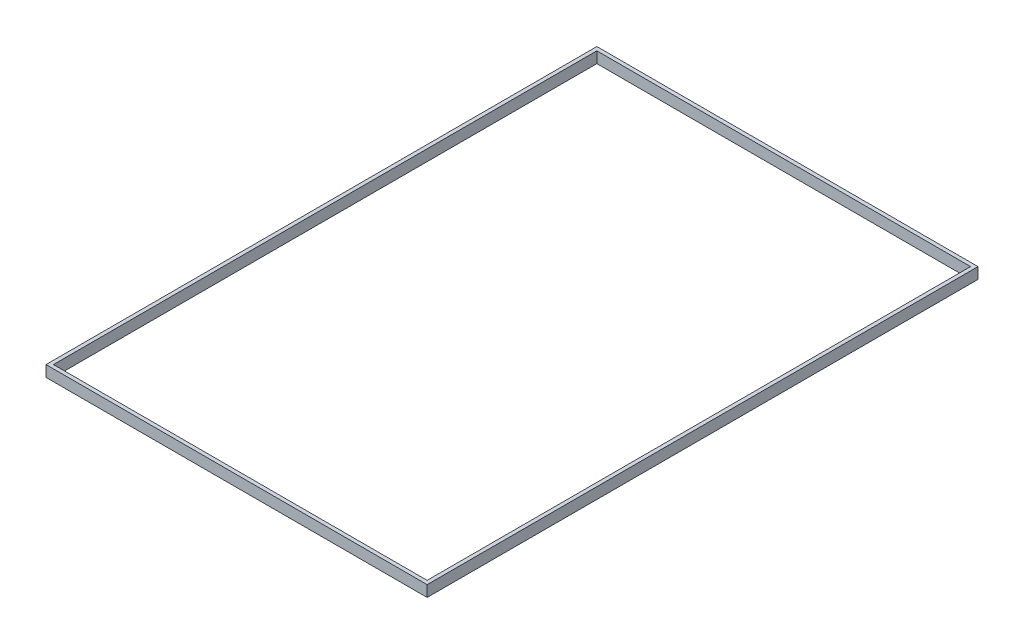
ISO-10303-21;
HEADER;
FILE_DESCRIPTION(('STEP AP214'),'2;1');
FILE_NAME('part.step','',(''),(''),'','','');
FILE_SCHEMA(('AUTOMOTIVE_DESIGN { 1 0 10303 214 1 1 1 1 }'));
ENDSEC;
DATA;
#1=APPLICATION_CONTEXT('core data for automotive mechanical design processes');
#2=APPLICATION_PROTOCOL_DEFINITION('international standard','automotive_design',2000,#1);
#3=PRODUCT_CONTEXT('',#1,'mechanical');
#4=PRODUCT('Part','Part','',(#3));
#5=PRODUCT_RELATED_PRODUCT_CATEGORY('part','',(#4));
#6=PRODUCT_DEFINITION_FORMATION('','',#4);
#7=PRODUCT_DEFINITION_CONTEXT('part definition',#1,'design');
#8=PRODUCT_DEFINITION('design','',#6,#7);
#9=PRODUCT_DEFINITION_SHAPE('','',#8);
#10=(LENGTH_UNIT() NAMED_UNIT(*) SI_UNIT(.MILLI.,.METRE.));
#11=(NAMED_UNIT(*) PLANE_ANGLE_UNIT() SI_UNIT($,.RADIAN.));
#12=(NAMED_UNIT(*) SI_UNIT($,.STERADIAN.) SOLID_ANGLE_UNIT());
#13=UNCERTAINTY_MEASURE_WITH_UNIT(LENGTH_MEASURE(1.E-05),#10,'distance_accuracy_value','');
#14=(GEOMETRIC_REPRESENTATION_CONTEXT(3) GLOBAL_UNCERTAINTY_ASSIGNED_CONTEXT((#13)) GLOBAL_UNIT_ASSIGNED_CONTEXT((#10,
#11,#12)) REPRESENTATION_CONTEXT('',''));
#15=CARTESIAN_POINT('',(0.,0.,0.));
#16=DIRECTION('',(0.,0.,1.));
#17=DIRECTION('',(1.,0.,0.));
#18=AXIS2_PLACEMENT_3D('',#15,#16,#17);
#19=CARTESIAN_POINT('',(0.,3.,0.));
#20=DIRECTION('',(0.,-1.,0.));
#21=DIRECTION('',(0.,0.,-1.));
#22=AXIS2_PLACEMENT_3D('',#19,#20,#21);
#23=PLANE('',#22);
#24=DIRECTION('',(0.,0.,1.));
#25=VECTOR('',#24,1.);
#26=CARTESIAN_POINT('',(0.,3.,0.));
#27=LINE('',#26,#25);
#28=CARTESIAN_POINT('',(0.,3.,-148.5));
#29=VERTEX_POINT('',#28);
#30=CARTESIAN_POINT('',(0.,3.,0.));
#31=VERTEX_POINT('',#30);
#32=EDGE_CURVE('E159',#29,#31,#27,.T.);
#33=ORIENTED_EDGE('',*,*,#32,.T.);
#34=DIRECTION('',(1.,0.,0.));
#35=VECTOR('',#34,1.);
#36=CARTESIAN_POINT('',(0.,3.,0.));
#37=LINE('',#36,#35);
#38=CARTESIAN_POINT('',(102.75,3.,0.));
#39=VERTEX_POINT('',#38);
#40=EDGE_CURVE('E163',#31,#39,#37,.T.);
#41=ORIENTED_EDGE('',*,*,#40,.T.);
#42=DIRECTION('',(0.,0.,-1.));
#43=VECTOR('',#42,1.);
#44=CARTESIAN_POINT('',(102.75,3.,0.));
#45=LINE('',#44,#43);
#46=CARTESIAN_POINT('',(102.75,3.,-148.5));
#47=VERTEX_POINT('',#46);
#48=EDGE_CURVE('E167',#39,#47,#45,.T.);
#49=ORIENTED_EDGE('',*,*,#48,.T.);
#50=DIRECTION('',(-1.,0.,0.));
#51=VECTOR('',#50,1.);
#52=CARTESIAN_POINT('',(0.,3.,-148.5));
#53=LINE('',#52,#51);
#54=EDGE_CURVE('E170',#47,#29,#53,.T.);
#55=ORIENTED_EDGE('',*,*,#54,.T.);
#56=EDGE_LOOP('',(#33,#41,#49,#55));
#57=FACE_BOUND('',#56,.T.);
#58=DIRECTION('',(0.,0.,-1.));
#59=VECTOR('',#58,1.);
#60=CARTESIAN_POINT('',(101.75,3.,-147.5));
#61=LINE('',#60,#59);
#62=CARTESIAN_POINT('',(101.75,3.,-1.));
#63=VERTEX_POINT('',#62);
#64=CARTESIAN_POINT('',(101.75,3.,-147.5));
#65=VERTEX_POINT('',#64);
#66=EDGE_CURVE('E111',#63,#65,#61,.T.);
#67=ORIENTED_EDGE('',*,*,#66,.F.);
#68=DIRECTION('',(1.,0.,0.));
#69=VECTOR('',#68,1.);
#70=CARTESIAN_POINT('',(101.75,3.,-1.));
#71=LINE('',#70,#69);
#72=CARTESIAN_POINT('',(1.,3.,-1.));
#73=VERTEX_POINT('',#72);
#74=EDGE_CURVE('E137',#73,#63,#71,.T.);
#75=ORIENTED_EDGE('',*,*,#74,.F.);
#76=DIRECTION('',(0.,0.,1.));
#77=VECTOR('',#76,1.);
#78=CARTESIAN_POINT('',(1.,3.,-1.));
#79=LINE('',#78,#77);
#80=CARTESIAN_POINT('',(1.,3.,-147.5));
#81=VERTEX_POINT('',#80);
#82=EDGE_CURVE('E133',#81,#73,#79,.T.);
#83=ORIENTED_EDGE('',*,*,#82,.F.);
#84=DIRECTION('',(-1.,0.,0.));
#85=VECTOR('',#84,1.);
#86=CARTESIAN_POINT('',(1.,3.,-147.5));
#87=LINE('',#86,#85);
#88=EDGE_CURVE('E120',#65,#81,#87,.T.);
#89=ORIENTED_EDGE('',*,*,#88,.F.);
#90=EDGE_LOOP('',(#67,#75,#83,#89));
#91=FACE_BOUND('',#90,.T.);
#92=ADVANCED_FACE('F45',(#57,#91),#23,.F.);
#93=CARTESIAN_POINT('',(0.,0.,0.));
#94=DIRECTION('',(0.,-1.,0.));
#95=DIRECTION('',(0.,0.,-1.));
#96=AXIS2_PLACEMENT_3D('',#93,#94,#95);
#97=PLANE('',#96);
#98=DIRECTION('',(0.,0.,1.));
#99=VECTOR('',#98,1.);
#100=CARTESIAN_POINT('',(0.,0.,0.));
#101=LINE('',#100,#99);
#102=CARTESIAN_POINT('',(0.,0.,-148.5));
#103=VERTEX_POINT('',#102);
#104=CARTESIAN_POINT('',(0.,0.,0.));
#105=VERTEX_POINT('',#104);
#106=EDGE_CURVE('E129',#103,#105,#101,.T.);
#107=ORIENTED_EDGE('',*,*,#106,.F.);
#108=DIRECTION('',(-1.,0.,0.));
#109=VECTOR('',#108,1.);
#110=CARTESIAN_POINT('',(0.,0.,-148.5));
#111=LINE('',#110,#109);
#112=CARTESIAN_POINT('',(102.75,0.,-148.5));
#113=VERTEX_POINT('',#112);
#114=EDGE_CURVE('E164',#113,#103,#111,.T.);
#115=ORIENTED_EDGE('',*,*,#114,.F.);
#116=DIRECTION('',(0.,0.,-1.));
#117=VECTOR('',#116,1.);
#118=CARTESIAN_POINT('',(102.75,0.,0.));
#119=LINE('',#118,#117);
#120=CARTESIAN_POINT('',(102.75,0.,0.));
#121=VERTEX_POINT('',#120);
#122=EDGE_CURVE('E180',#121,#113,#119,.T.);
#123=ORIENTED_EDGE('',*,*,#122,.F.);
#124=DIRECTION('',(1.,0.,0.));
#125=VECTOR('',#124,1.);
#126=CARTESIAN_POINT('',(0.,0.,0.));
#127=LINE('',#126,#125);
#128=EDGE_CURVE('E177',#105,#121,#127,.T.);
#129=ORIENTED_EDGE('',*,*,#128,.F.);
#130=EDGE_LOOP('',(#107,#115,#123,#129));
#131=FACE_BOUND('',#130,.T.);
#132=DIRECTION('',(1.,0.,0.));
#133=VECTOR('',#132,1.);
#134=CARTESIAN_POINT('',(101.75,0.,-1.));
#135=LINE('',#134,#133);
#136=CARTESIAN_POINT('',(1.,0.,-1.));
#137=VERTEX_POINT('',#136);
#138=CARTESIAN_POINT('',(101.75,0.,-1.));
#139=VERTEX_POINT('',#138);
#140=EDGE_CURVE('E121',#137,#139,#135,.T.);
#141=ORIENTED_EDGE('',*,*,#140,.T.);
#142=DIRECTION('',(0.,0.,-1.));
#143=VECTOR('',#142,1.);
#144=CARTESIAN_POINT('',(101.75,0.,-147.5));
#145=LINE('',#144,#143);
#146=CARTESIAN_POINT('',(101.75,0.,-147.5));
#147=VERTEX_POINT('',#146);
#148=EDGE_CURVE('E69',#139,#147,#145,.T.);
#149=ORIENTED_EDGE('',*,*,#148,.T.);
#150=DIRECTION('',(-1.,0.,0.));
#151=VECTOR('',#150,1.);
#152=CARTESIAN_POINT('',(1.,0.,-147.5));
#153=LINE('',#152,#151);
#154=CARTESIAN_POINT('',(1.,0.,-147.5));
#155=VERTEX_POINT('',#154);
#156=EDGE_CURVE('E127',#147,#155,#153,.T.);
#157=ORIENTED_EDGE('',*,*,#156,.T.);
#158=DIRECTION('',(0.,0.,1.));
#159=VECTOR('',#158,1.);
#160=CARTESIAN_POINT('',(1.,0.,-1.));
#161=LINE('',#160,#159);
#162=EDGE_CURVE('E146',#155,#137,#161,.T.);
#163=ORIENTED_EDGE('',*,*,#162,.T.);
#164=EDGE_LOOP('',(#141,#149,#157,#163));
#165=FACE_BOUND('',#164,.T.);
#166=ADVANCED_FACE('F203',(#131,#165),#97,.T.);
#167=CARTESIAN_POINT('',(0.,3.,0.));
#168=DIRECTION('',(1.,0.,0.));
#169=DIRECTION('',(0.,0.,-1.));
#170=AXIS2_PLACEMENT_3D('',#167,#168,#169);
#171=PLANE('',#170);
#172=ORIENTED_EDGE('',*,*,#106,.T.);
#173=DIRECTION('',(0.,-1.,0.));
#174=VECTOR('',#173,1.);
#175=CARTESIAN_POINT('',(0.,3.,0.));
#176=LINE('',#175,#174);
#177=EDGE_CURVE('E11',#31,#105,#176,.T.);
#178=ORIENTED_EDGE('',*,*,#177,.F.);
#179=ORIENTED_EDGE('',*,*,#32,.F.);
#180=DIRECTION('',(0.,-1.,0.));
#181=VECTOR('',#180,1.);
#182=CARTESIAN_POINT('',(0.,3.,-148.5));
#183=LINE('',#182,#181);
#184=EDGE_CURVE('E173',#29,#103,#183,.T.);
#185=ORIENTED_EDGE('',*,*,#184,.T.);
#186=EDGE_LOOP('',(#172,#178,#179,#185));
#187=FACE_BOUND('',#186,.T.);
#188=ADVANCED_FACE('F47',(#187),#171,.F.);
#189=CARTESIAN_POINT('',(0.,3.,0.));
#190=DIRECTION('',(0.,0.,-1.));
#191=DIRECTION('',(-1.,0.,0.));
#192=AXIS2_PLACEMENT_3D('',#189,#190,#191);
#193=PLANE('',#192);
#194=ORIENTED_EDGE('',*,*,#128,.T.);
#195=DIRECTION('',(0.,-1.,0.));
#196=VECTOR('',#195,1.);
#197=CARTESIAN_POINT('',(102.75,3.,0.));
#198=LINE('',#197,#196);
#199=EDGE_CURVE('E54',#39,#121,#198,.T.);
#200=ORIENTED_EDGE('',*,*,#199,.F.);
#201=ORIENTED_EDGE('',*,*,#40,.F.);
#202=ORIENTED_EDGE('',*,*,#177,.T.);
#203=EDGE_LOOP('',(#194,#200,#201,#202));
#204=FACE_BOUND('',#203,.T.);
#205=ADVANCED_FACE('F213',(#204),#193,.F.);
#206=CARTESIAN_POINT('',(102.75,3.,0.));
#207=DIRECTION('',(-1.,0.,0.));
#208=DIRECTION('',(0.,0.,1.));
#209=AXIS2_PLACEMENT_3D('',#206,#207,#208);
#210=PLANE('',#209);
#211=ORIENTED_EDGE('',*,*,#122,.T.);
#212=DIRECTION('',(0.,-1.,0.));
#213=VECTOR('',#212,1.);
#214=CARTESIAN_POINT('',(102.75,3.,-148.5));
#215=LINE('',#214,#213);
#216=EDGE_CURVE('E188',#47,#113,#215,.T.);
#217=ORIENTED_EDGE('',*,*,#216,.F.);
#218=ORIENTED_EDGE('',*,*,#48,.F.);
#219=ORIENTED_EDGE('',*,*,#199,.T.);
#220=EDGE_LOOP('',(#211,#217,#218,#219));
#221=FACE_BOUND('',#220,.T.);
#222=ADVANCED_FACE('F197',(#221),#210,.F.);
#223=CARTESIAN_POINT('',(0.,3.,-148.5));
#224=DIRECTION('',(0.,0.,1.));
#225=DIRECTION('',(1.,0.,0.));
#226=AXIS2_PLACEMENT_3D('',#223,#224,#225);
#227=PLANE('',#226);
#228=ORIENTED_EDGE('',*,*,#114,.T.);
#229=ORIENTED_EDGE('',*,*,#184,.F.);
#230=ORIENTED_EDGE('',*,*,#54,.F.);
#231=ORIENTED_EDGE('',*,*,#216,.T.);
#232=EDGE_LOOP('',(#228,#229,#230,#231));
#233=FACE_BOUND('',#232,.T.);
#234=ADVANCED_FACE('F207',(#233),#227,.F.);
#235=CARTESIAN_POINT('',(101.75,3.,-147.5));
#236=DIRECTION('',(-1.,0.,0.));
#237=DIRECTION('',(0.,0.,1.));
#238=AXIS2_PLACEMENT_3D('',#235,#236,#237);
#239=PLANE('',#238);
#240=ORIENTED_EDGE('',*,*,#148,.F.);
#241=DIRECTION('',(0.,-1.,0.));
#242=VECTOR('',#241,1.);
#243=CARTESIAN_POINT('',(101.75,3.,-1.));
#244=LINE('',#243,#242);
#245=EDGE_CURVE('E115',#63,#139,#244,.T.);
#246=ORIENTED_EDGE('',*,*,#245,.F.);
#247=ORIENTED_EDGE('',*,*,#66,.T.);
#248=DIRECTION('',(0.,-1.,0.));
#249=VECTOR('',#248,1.);
#250=CARTESIAN_POINT('',(101.75,3.,-147.5));
#251=LINE('',#250,#249);
#252=EDGE_CURVE('E114',#65,#147,#251,.T.);
#253=ORIENTED_EDGE('',*,*,#252,.T.);
#254=EDGE_LOOP('',(#240,#246,#247,#253));
#255=FACE_BOUND('',#254,.T.);
#256=ADVANCED_FACE('F113',(#255),#239,.T.);
#257=CARTESIAN_POINT('',(1.,3.,-147.5));
#258=DIRECTION('',(0.,0.,1.));
#259=DIRECTION('',(1.,0.,0.));
#260=AXIS2_PLACEMENT_3D('',#257,#258,#259);
#261=PLANE('',#260);
#262=ORIENTED_EDGE('',*,*,#156,.F.);
#263=ORIENTED_EDGE('',*,*,#252,.F.);
#264=ORIENTED_EDGE('',*,*,#88,.T.);
#265=DIRECTION('',(0.,-1.,0.));
#266=VECTOR('',#265,1.);
#267=CARTESIAN_POINT('',(1.,3.,-147.5));
#268=LINE('',#267,#266);
#269=EDGE_CURVE('E130',#81,#155,#268,.T.);
#270=ORIENTED_EDGE('',*,*,#269,.T.);
#271=EDGE_LOOP('',(#262,#263,#264,#270));
#272=FACE_BOUND('',#271,.T.);
#273=ADVANCED_FACE('F124',(#272),#261,.T.);
#274=CARTESIAN_POINT('',(1.,3.,-1.));
#275=DIRECTION('',(1.,0.,0.));
#276=DIRECTION('',(0.,0.,-1.));
#277=AXIS2_PLACEMENT_3D('',#274,#275,#276);
#278=PLANE('',#277);
#279=ORIENTED_EDGE('',*,*,#162,.F.);
#280=ORIENTED_EDGE('',*,*,#269,.F.);
#281=ORIENTED_EDGE('',*,*,#82,.T.);
#282=DIRECTION('',(0.,-1.,0.));
#283=VECTOR('',#282,1.);
#284=CARTESIAN_POINT('',(1.,3.,-1.));
#285=LINE('',#284,#283);
#286=EDGE_CURVE('E61',#73,#137,#285,.T.);
#287=ORIENTED_EDGE('',*,*,#286,.T.);
#288=EDGE_LOOP('',(#279,#280,#281,#287));
#289=FACE_BOUND('',#288,.T.);
#290=ADVANCED_FACE('F236',(#289),#278,.T.);
#291=CARTESIAN_POINT('',(101.75,3.,-1.));
#292=DIRECTION('',(0.,0.,-1.));
#293=DIRECTION('',(-1.,0.,0.));
#294=AXIS2_PLACEMENT_3D('',#291,#292,#293);
#295=PLANE('',#294);
#296=ORIENTED_EDGE('',*,*,#140,.F.);
#297=ORIENTED_EDGE('',*,*,#286,.F.);
#298=ORIENTED_EDGE('',*,*,#74,.T.);
#299=ORIENTED_EDGE('',*,*,#245,.T.);
#300=EDGE_LOOP('',(#296,#297,#298,#299));
#301=FACE_BOUND('',#300,.T.);
#302=ADVANCED_FACE('F240',(#301),#295,.T.);
#303=CLOSED_SHELL('',(#92,#166,#188,#205,#222,#234,#256,#273,#290,#302));
#304=MANIFOLD_SOLID_BREP('B2',#303);
#305=ADVANCED_BREP_SHAPE_REPRESENTATION('',(#18,#304),#14);
#306=SHAPE_DEFINITION_REPRESENTATION(#9,#305);
ENDSEC;
END-ISO-10303-21;
